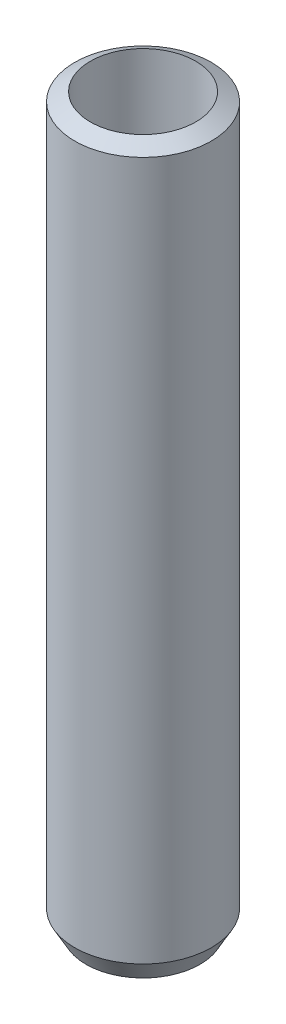
ISO-10303-21;
HEADER;
FILE_DESCRIPTION(('STEP AP214'),'2;1');
FILE_NAME('part.step','',(''),(''),'','','');
FILE_SCHEMA(('AUTOMOTIVE_DESIGN { 1 0 10303 214 1 1 1 1 }'));
ENDSEC;
DATA;
#1=APPLICATION_CONTEXT('core data for automotive mechanical design processes');
#2=APPLICATION_PROTOCOL_DEFINITION('international standard','automotive_design',2000,#1);
#3=PRODUCT_CONTEXT('',#1,'mechanical');
#4=PRODUCT('Part','Part','',(#3));
#5=PRODUCT_RELATED_PRODUCT_CATEGORY('part','',(#4));
#6=PRODUCT_DEFINITION_FORMATION('','',#4);
#7=PRODUCT_DEFINITION_CONTEXT('part definition',#1,'design');
#8=PRODUCT_DEFINITION('design','',#6,#7);
#9=PRODUCT_DEFINITION_SHAPE('','',#8);
#10=(LENGTH_UNIT() NAMED_UNIT(*) SI_UNIT(.MILLI.,.METRE.));
#11=(NAMED_UNIT(*) PLANE_ANGLE_UNIT() SI_UNIT($,.RADIAN.));
#12=(NAMED_UNIT(*) SI_UNIT($,.STERADIAN.) SOLID_ANGLE_UNIT());
#13=UNCERTAINTY_MEASURE_WITH_UNIT(LENGTH_MEASURE(1.E-05),#10,'distance_accuracy_value','');
#14=(GEOMETRIC_REPRESENTATION_CONTEXT(3) GLOBAL_UNCERTAINTY_ASSIGNED_CONTEXT((#13)) GLOBAL_UNIT_ASSIGNED_CONTEXT((#10,
#11,#12)) REPRESENTATION_CONTEXT('',''));
#15=CARTESIAN_POINT('',(0.,0.,0.));
#16=DIRECTION('',(0.,0.,1.));
#17=DIRECTION('',(1.,0.,0.));
#18=AXIS2_PLACEMENT_3D('',#15,#16,#17);
#19=CARTESIAN_POINT('',(0.,374.155456267531,0.));
#20=DIRECTION('',(0.,-1.,0.));
#21=DIRECTION('',(0.,0.,-1.));
#22=AXIS2_PLACEMENT_3D('',#19,#20,#21);
#23=CYLINDRICAL_SURFACE('',#22,35.);
#24=CARTESIAN_POINT('',(0.,368.371878324543,0.));
#25=DIRECTION('',(0.,1.,0.));
#26=DIRECTION('',(0.,0.,1.));
#27=AXIS2_PLACEMENT_3D('',#24,#25,#26);
#28=CIRCLE('',#27,35.);
#29=CARTESIAN_POINT('',(0.,368.371878324543,-35.0000000000001));
#30=VERTEX_POINT('',#29);
#31=EDGE_CURVE('E50',#30,#30,#28,.F.);
#32=ORIENTED_EDGE('',*,*,#31,.T.);
#33=EDGE_LOOP('',(#32));
#34=FACE_BOUND('',#33,.T.);
#35=CARTESIAN_POINT('',(0.,10.2952197385771,0.));
#36=DIRECTION('',(0.,1.,0.));
#37=DIRECTION('',(0.,0.,1.));
#38=AXIS2_PLACEMENT_3D('',#35,#36,#37);
#39=CIRCLE('',#38,35.);
#40=CARTESIAN_POINT('',(0.,10.2952197385771,35.));
#41=VERTEX_POINT('',#40);
#42=EDGE_CURVE('E51',#41,#41,#39,.T.);
#43=ORIENTED_EDGE('',*,*,#42,.T.);
#44=EDGE_LOOP('',(#43));
#45=FACE_BOUND('',#44,.T.);
#46=ADVANCED_FACE('F39',(#34,#45),#23,.T.);
#47=CARTESIAN_POINT('',(0.,0.,0.));
#48=DIRECTION('',(0.,1.,0.));
#49=DIRECTION('',(0.,0.,1.));
#50=AXIS2_PLACEMENT_3D('',#47,#48,#49);
#51=PLANE('',#50);
#52=CARTESIAN_POINT('',(0.,0.,0.));
#53=DIRECTION('',(0.,1.,0.));
#54=DIRECTION('',(0.,0.,1.));
#55=AXIS2_PLACEMENT_3D('',#52,#53,#54);
#56=CIRCLE('',#55,29.2164220570119);
#57=CARTESIAN_POINT('',(0.,0.,29.2164220570119));
#58=VERTEX_POINT('',#57);
#59=EDGE_CURVE('E10',#58,#58,#56,.F.);
#60=ORIENTED_EDGE('',*,*,#59,.T.);
#61=EDGE_LOOP('',(#60));
#62=FACE_BOUND('',#61,.T.);
#63=CARTESIAN_POINT('',(0.,0.,0.));
#64=DIRECTION('',(0.,1.,0.));
#65=DIRECTION('',(0.,0.,1.));
#66=AXIS2_PLACEMENT_3D('',#63,#64,#65);
#67=CIRCLE('',#66,27.0104442371761);
#68=CARTESIAN_POINT('',(0.,0.,27.0104442371761));
#69=VERTEX_POINT('',#68);
#70=EDGE_CURVE('E58',#69,#69,#67,.T.);
#71=ORIENTED_EDGE('',*,*,#70,.T.);
#72=EDGE_LOOP('',(#71));
#73=FACE_BOUND('',#72,.T.);
#74=ADVANCED_FACE('F62',(#62,#73),#51,.F.);
#75=CARTESIAN_POINT('',(0.,374.155456267531,0.));
#76=DIRECTION('',(0.,-1.,0.));
#77=DIRECTION('',(0.,0.,-1.));
#78=AXIS2_PLACEMENT_3D('',#75,#76,#77);
#79=CYLINDRICAL_SURFACE('',#78,27.0104442371761);
#80=CARTESIAN_POINT('',(0.,372.860196170834,0.));
#81=DIRECTION('',(0.,-1.,0.));
#82=DIRECTION('',(0.,0.,-1.));
#83=AXIS2_PLACEMENT_3D('',#80,#81,#82);
#84=CIRCLE('',#83,27.0104442371761);
#85=CARTESIAN_POINT('',(0.,372.860196170834,-27.010444237176));
#86=VERTEX_POINT('',#85);
#87=EDGE_CURVE('E54',#86,#86,#84,.F.);
#88=ORIENTED_EDGE('',*,*,#87,.T.);
#89=EDGE_LOOP('',(#88));
#90=FACE_BOUND('',#89,.T.);
#91=ORIENTED_EDGE('',*,*,#70,.F.);
#92=EDGE_LOOP('',(#91));
#93=FACE_BOUND('',#92,.T.);
#94=ADVANCED_FACE('F68',(#90,#93),#79,.F.);
#95=CARTESIAN_POINT('',(0.,374.155456267531,0.));
#96=DIRECTION('',(0.,-1.,0.));
#97=DIRECTION('',(0.,0.,-1.));
#98=AXIS2_PLACEMENT_3D('',#95,#96,#97);
#99=CONICAL_SURFACE('',#98,24.7047802614227,1.05895919101893);
#100=CARTESIAN_POINT('',(0.,368.371878324543,-35.0000000000001));
#101=CARTESIAN_POINT('',(0.,368.418631635441,-34.916775460804));
#102=CARTESIAN_POINT('',(0.,368.46538494634,-34.8335509216079));
#103=CARTESIAN_POINT('',(0.,368.558891568138,-34.6671018432157));
#104=CARTESIAN_POINT('',(0.,368.605644879037,-34.5838773040197));
#105=CARTESIAN_POINT('',(0.,368.699151500835,-34.4174282256275));
#106=CARTESIAN_POINT('',(0.,368.745904811734,-34.3342036864314));
#107=CARTESIAN_POINT('',(0.,368.839411433531,-34.1677546080392));
#108=CARTESIAN_POINT('',(0.,368.88616474443,-34.0845300688432));
#109=CARTESIAN_POINT('',(0.,368.979671366228,-33.918080990451));
#110=CARTESIAN_POINT('',(0.,369.026424677127,-33.8348564512549));
#111=CARTESIAN_POINT('',(0.,369.119931298924,-33.6684073728627));
#112=CARTESIAN_POINT('',(0.,369.166684609823,-33.5851828336667));
#113=CARTESIAN_POINT('',(0.,369.260191231621,-33.4187337552745));
#114=CARTESIAN_POINT('',(0.,369.30694454252,-33.3355092160784));
#115=CARTESIAN_POINT('',(0.,369.400451164318,-33.1690601376862));
#116=CARTESIAN_POINT('',(0.,369.447204475216,-33.0858355984901));
#117=CARTESIAN_POINT('',(0.,369.540711097014,-32.919386520098));
#118=CARTESIAN_POINT('',(0.,369.587464407913,-32.8361619809019));
#119=CARTESIAN_POINT('',(0.,369.680971029711,-32.6697129025097));
#120=CARTESIAN_POINT('',(0.,369.72772434061,-32.5864883633136));
#121=CARTESIAN_POINT('',(0.,369.821230962407,-32.4200392849215));
#122=CARTESIAN_POINT('',(0.,369.867984273306,-32.3368147457254));
#123=CARTESIAN_POINT('',(0.,369.961490895104,-32.1703656673332));
#124=CARTESIAN_POINT('',(0.,370.008244206003,-32.0871411281371));
#125=CARTESIAN_POINT('',(0.,370.101750827801,-31.920692049745));
#126=CARTESIAN_POINT('',(0.,370.148504138699,-31.8374675105489));
#127=CARTESIAN_POINT('',(0.,370.242010760497,-31.6710184321567));
#128=CARTESIAN_POINT('',(0.,370.288764071396,-31.5877938929606));
#129=CARTESIAN_POINT('',(0.,370.382270693194,-31.4213448145685));
#130=CARTESIAN_POINT('',(0.,370.429024004093,-31.3381202753724));
#131=CARTESIAN_POINT('',(0.,370.52253062589,-31.1716711969802));
#132=CARTESIAN_POINT('',(0.,370.569283936789,-31.0884466577841));
#133=CARTESIAN_POINT('',(0.,370.662790558587,-30.921997579392));
#134=CARTESIAN_POINT('',(0.,370.709543869486,-30.8387730401959));
#135=CARTESIAN_POINT('',(0.,370.803050491284,-30.6723239618037));
#136=CARTESIAN_POINT('',(0.,370.849803802182,-30.5890994226076));
#137=CARTESIAN_POINT('',(0.,370.94331042398,-30.4226503442155));
#138=CARTESIAN_POINT('',(0.,370.990063734879,-30.3394258050194));
#139=CARTESIAN_POINT('',(0.,371.083570356677,-30.1729767266272));
#140=CARTESIAN_POINT('',(0.,371.130323667576,-30.0897521874311));
#141=CARTESIAN_POINT('',(0.,371.223830289373,-29.923303109039));
#142=CARTESIAN_POINT('',(0.,371.270583600272,-29.8400785698429));
#143=CARTESIAN_POINT('',(0.,371.36409022207,-29.6736294914507));
#144=CARTESIAN_POINT('',(0.,371.410843532969,-29.5904049522546));
#145=CARTESIAN_POINT('',(0.,371.504350154767,-29.4239558738625));
#146=CARTESIAN_POINT('',(0.,371.551103465665,-29.3407313346664));
#147=CARTESIAN_POINT('',(0.,371.644610087463,-29.1742822562742));
#148=CARTESIAN_POINT('',(0.,371.691363398362,-29.0910577170781));
#149=CARTESIAN_POINT('',(0.,371.78487002016,-28.924608638686));
#150=CARTESIAN_POINT('',(0.,371.831623331059,-28.8413840994899));
#151=CARTESIAN_POINT('',(0.,371.925129952856,-28.6749350210977));
#152=CARTESIAN_POINT('',(0.,371.971883263755,-28.5917104819016));
#153=CARTESIAN_POINT('',(0.,372.065389885553,-28.4252614035095));
#154=CARTESIAN_POINT('',(0.,372.112143196452,-28.3420368643134));
#155=CARTESIAN_POINT('',(0.,372.205649818249,-28.1755877859212));
#156=CARTESIAN_POINT('',(0.,372.252403129148,-28.0923632467251));
#157=CARTESIAN_POINT('',(0.,372.345909750946,-27.925914168333));
#158=CARTESIAN_POINT('',(0.,372.392663061845,-27.8426896291369));
#159=CARTESIAN_POINT('',(0.,372.486169683643,-27.6762405507447));
#160=CARTESIAN_POINT('',(0.,372.532922994541,-27.5930160115486));
#161=CARTESIAN_POINT('',(0.,372.626429616339,-27.4265669331564));
#162=CARTESIAN_POINT('',(0.,372.673182927238,-27.3433423939604));
#163=CARTESIAN_POINT('',(0.,372.766689549036,-27.1768933155682));
#164=CARTESIAN_POINT('',(0.,372.813442859935,-27.0936687763721));
#165=CARTESIAN_POINT('',(0.,372.860196170834,-27.010444237176));
#166=B_SPLINE_CURVE_WITH_KNOTS('',3,(#100,#101,#102,#103,#104,#105,#106,#107,#108,#109,#110,
#111,#112,#113,#114,#115,#116,#117,#118,#119,#120,#121,#122,#123,#124,#125,#126,#127,#128,#129,
#130,#131,#132,#133,#134,#135,#136,#137,#138,#139,#140,#141,#142,#143,#144,#145,#146,#147,#148,
#149,#150,#151,#152,#153,#154,#155,#156,#157,#158,#159,#160,#161,#162,#163,#164,#165),
.UNSPECIFIED.,.F.,.F.,(4,2,2,2,2,2,2,2,2,2,2,2,2,2,2,2,2,2,2,2,2,2,2,2,2,2,2,2,2,2,2,2,4),(0.,
0.286373469510818,0.572746939021637,0.859120408532428,1.14549387804325,1.43186734755404,
1.71824081706486,2.00461428657565,2.29098775608647,2.57736122559726,2.86373469510808,
3.15010816461887,3.43648163412969,3.72285510364048,4.0092285731513,4.29560204266209,
4.58197551217291,4.86834898168373,5.15472245119452,5.44109592070534,5.72746939021613,
6.01384285972695,6.30021632923774,6.58658979874856,6.87296326825935,7.15933673777017,
7.44571020728096,7.73208367679178,8.01845714630257,8.30483061581339,8.59120408532418,
8.877577554835,9.16395102434582),.UNSPECIFIED.);
#167=EDGE_CURVE('BSEAM66',#30,#86,#166,.T.);
#168=ORIENTED_EDGE('',*,*,#31,.F.);
#169=ORIENTED_EDGE('',*,*,#87,.F.);
#170=ORIENTED_EDGE('',*,*,#167,.T.);
#171=ORIENTED_EDGE('',*,*,#167,.F.);
#172=EDGE_LOOP('',(#168,#170,#169,#171));
#173=FACE_BOUND('',#172,.T.);
#174=ADVANCED_FACE('F66',(#173),#99,.T.);
#175=CARTESIAN_POINT('',(0.,10.2952197385771,0.));
#176=DIRECTION('',(0.,1.,0.));
#177=DIRECTION('',(0.,0.,1.));
#178=AXIS2_PLACEMENT_3D('',#175,#176,#177);
#179=CONICAL_SURFACE('',#178,35.,0.51183713577597);
#180=ORIENTED_EDGE('',*,*,#59,.F.);
#181=EDGE_LOOP('',(#180));
#182=FACE_BOUND('',#181,.T.);
#183=ORIENTED_EDGE('',*,*,#42,.F.);
#184=EDGE_LOOP('',(#183));
#185=FACE_BOUND('',#184,.T.);
#186=ADVANCED_FACE('F45',(#182,#185),#179,.T.);
#187=CLOSED_SHELL('',(#46,#74,#94,#174,#186));
#188=MANIFOLD_SOLID_BREP('B2',#187);
#189=ADVANCED_BREP_SHAPE_REPRESENTATION('',(#18,#188),#14);
#190=SHAPE_DEFINITION_REPRESENTATION(#9,#189);
ENDSEC;
END-ISO-10303-21;
